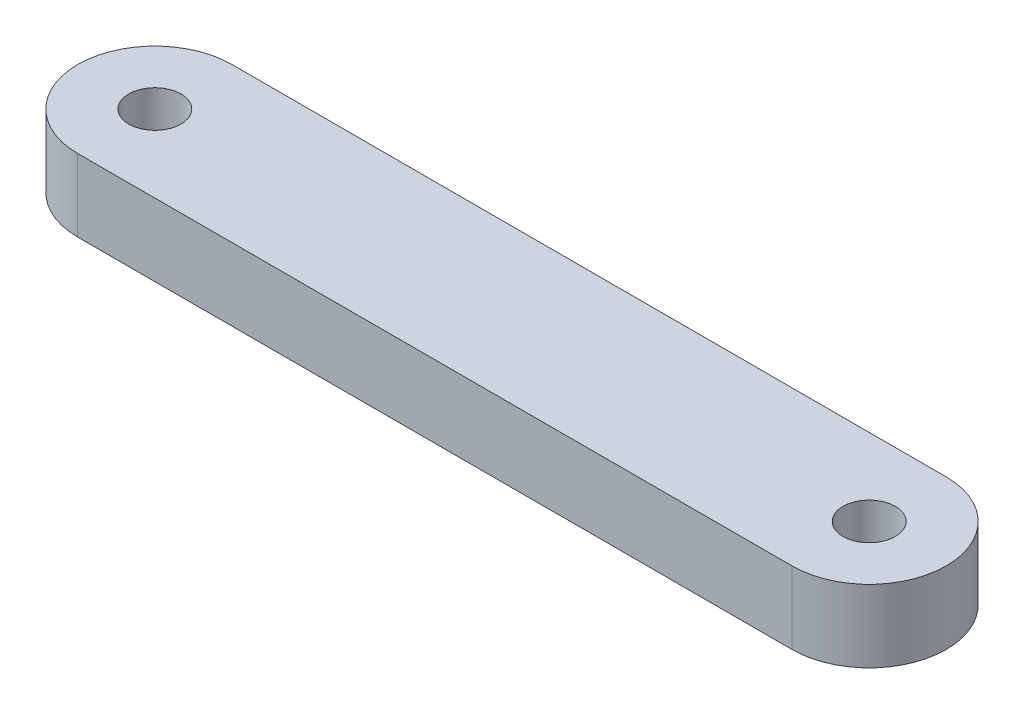
ISO-10303-21;
HEADER;
FILE_DESCRIPTION(('STEP AP214'),'2;1');
FILE_NAME('part.step','',(''),(''),'','','');
FILE_SCHEMA(('AUTOMOTIVE_DESIGN { 1 0 10303 214 1 1 1 1 }'));
ENDSEC;
DATA;
#1=APPLICATION_CONTEXT('core data for automotive mechanical design processes');
#2=APPLICATION_PROTOCOL_DEFINITION('international standard','automotive_design',2000,#1);
#3=PRODUCT_CONTEXT('',#1,'mechanical');
#4=PRODUCT('Part','Part','',(#3));
#5=PRODUCT_RELATED_PRODUCT_CATEGORY('part','',(#4));
#6=PRODUCT_DEFINITION_FORMATION('','',#4);
#7=PRODUCT_DEFINITION_CONTEXT('part definition',#1,'design');
#8=PRODUCT_DEFINITION('design','',#6,#7);
#9=PRODUCT_DEFINITION_SHAPE('','',#8);
#10=(LENGTH_UNIT() NAMED_UNIT(*) SI_UNIT(.MILLI.,.METRE.));
#11=(NAMED_UNIT(*) PLANE_ANGLE_UNIT() SI_UNIT($,.RADIAN.));
#12=(NAMED_UNIT(*) SI_UNIT($,.STERADIAN.) SOLID_ANGLE_UNIT());
#13=UNCERTAINTY_MEASURE_WITH_UNIT(LENGTH_MEASURE(1.E-05),#10,'distance_accuracy_value','');
#14=(GEOMETRIC_REPRESENTATION_CONTEXT(3) GLOBAL_UNCERTAINTY_ASSIGNED_CONTEXT((#13)) GLOBAL_UNIT_ASSIGNED_CONTEXT((#10,
#11,#12)) REPRESENTATION_CONTEXT('',''));
#15=CARTESIAN_POINT('',(0.,0.,0.));
#16=DIRECTION('',(0.,0.,1.));
#17=DIRECTION('',(1.,0.,0.));
#18=AXIS2_PLACEMENT_3D('',#15,#16,#17);
#19=CARTESIAN_POINT('',(0.,6.35,0.));
#20=DIRECTION('',(0.,1.,0.));
#21=DIRECTION('',(0.,0.,1.));
#22=AXIS2_PLACEMENT_3D('',#19,#20,#21);
#23=PLANE('',#22);
#24=CARTESIAN_POINT('',(-62.6695186481077,6.35,0.));
#25=DIRECTION('',(0.,1.,0.));
#26=DIRECTION('',(0.,0.,1.));
#27=AXIS2_PLACEMENT_3D('',#24,#25,#26);
#28=CIRCLE('',#27,2.29235);
#29=CARTESIAN_POINT('',(-62.6695186481077,6.35,2.29235));
#30=VERTEX_POINT('',#29);
#31=EDGE_CURVE('E100',#30,#30,#28,.T.);
#32=ORIENTED_EDGE('',*,*,#31,.F.);
#33=EDGE_LOOP('',(#32));
#34=FACE_BOUND('',#33,.T.);
#35=CARTESIAN_POINT('',(0.,6.35,0.));
#36=DIRECTION('',(0.,1.,0.));
#37=DIRECTION('',(0.,0.,1.));
#38=AXIS2_PLACEMENT_3D('',#35,#36,#37);
#39=CIRCLE('',#38,6.76524067594616);
#40=CARTESIAN_POINT('',(0.,6.35,6.76524067594616));
#41=VERTEX_POINT('',#40);
#42=CARTESIAN_POINT('',(0.,6.35,-6.76524067594616));
#43=VERTEX_POINT('',#42);
#44=EDGE_CURVE('E85',#41,#43,#39,.T.);
#45=ORIENTED_EDGE('',*,*,#44,.T.);
#46=DIRECTION('',(-1.,0.,0.));
#47=VECTOR('',#46,1.);
#48=CARTESIAN_POINT('',(0.,6.35,-6.76524067594616));
#49=LINE('',#48,#47);
#50=CARTESIAN_POINT('',(-62.6695186481077,6.35,-6.76524067594615));
#51=VERTEX_POINT('',#50);
#52=EDGE_CURVE('E80',#43,#51,#49,.T.);
#53=ORIENTED_EDGE('',*,*,#52,.T.);
#54=CARTESIAN_POINT('',(-62.6695186481077,6.35,0.));
#55=DIRECTION('',(0.,1.,0.));
#56=DIRECTION('',(0.,0.,1.));
#57=AXIS2_PLACEMENT_3D('',#54,#55,#56);
#58=CIRCLE('',#57,6.76524067594616);
#59=CARTESIAN_POINT('',(-62.6695186481077,6.35,6.76524067594616));
#60=VERTEX_POINT('',#59);
#61=EDGE_CURVE('E83',#51,#60,#58,.T.);
#62=ORIENTED_EDGE('',*,*,#61,.T.);
#63=DIRECTION('',(1.,0.,0.));
#64=VECTOR('',#63,1.);
#65=CARTESIAN_POINT('',(0.,6.35,6.76524067594616));
#66=LINE('',#65,#64);
#67=EDGE_CURVE('E50',#60,#41,#66,.T.);
#68=ORIENTED_EDGE('',*,*,#67,.T.);
#69=EDGE_LOOP('',(#45,#53,#62,#68));
#70=FACE_BOUND('',#69,.T.);
#71=CARTESIAN_POINT('',(0.,6.35,0.));
#72=DIRECTION('',(0.,1.,0.));
#73=DIRECTION('',(0.,0.,1.));
#74=AXIS2_PLACEMENT_3D('',#71,#72,#73);
#75=CIRCLE('',#74,2.29235);
#76=CARTESIAN_POINT('',(0.,6.35,2.29235));
#77=VERTEX_POINT('',#76);
#78=EDGE_CURVE('E115',#77,#77,#75,.T.);
#79=ORIENTED_EDGE('',*,*,#78,.F.);
#80=EDGE_LOOP('',(#79));
#81=FACE_BOUND('',#80,.T.);
#82=ADVANCED_FACE('F33',(#34,#70,#81),#23,.T.);
#83=CARTESIAN_POINT('',(0.,0.,0.));
#84=DIRECTION('',(0.,1.,0.));
#85=DIRECTION('',(0.,0.,1.));
#86=AXIS2_PLACEMENT_3D('',#83,#84,#85);
#87=PLANE('',#86);
#88=CARTESIAN_POINT('',(0.,0.,0.));
#89=DIRECTION('',(0.,1.,0.));
#90=DIRECTION('',(0.,0.,1.));
#91=AXIS2_PLACEMENT_3D('',#88,#89,#90);
#92=CIRCLE('',#91,6.76524067594616);
#93=CARTESIAN_POINT('',(0.,0.,6.76524067594616));
#94=VERTEX_POINT('',#93);
#95=CARTESIAN_POINT('',(0.,0.,-6.76524067594616));
#96=VERTEX_POINT('',#95);
#97=EDGE_CURVE('E97',#94,#96,#92,.T.);
#98=ORIENTED_EDGE('',*,*,#97,.F.);
#99=DIRECTION('',(1.,0.,0.));
#100=VECTOR('',#99,1.);
#101=CARTESIAN_POINT('',(0.,0.,6.76524067594616));
#102=LINE('',#101,#100);
#103=CARTESIAN_POINT('',(-62.6695186481077,0.,6.76524067594616));
#104=VERTEX_POINT('',#103);
#105=EDGE_CURVE('E73',#104,#94,#102,.T.);
#106=ORIENTED_EDGE('',*,*,#105,.F.);
#107=CARTESIAN_POINT('',(-62.6695186481077,0.,0.));
#108=DIRECTION('',(0.,1.,0.));
#109=DIRECTION('',(0.,0.,1.));
#110=AXIS2_PLACEMENT_3D('',#107,#108,#109);
#111=CIRCLE('',#110,6.76524067594616);
#112=CARTESIAN_POINT('',(-62.6695186481077,0.,-6.76524067594615));
#113=VERTEX_POINT('',#112);
#114=EDGE_CURVE('E67',#113,#104,#111,.T.);
#115=ORIENTED_EDGE('',*,*,#114,.F.);
#116=DIRECTION('',(-1.,0.,0.));
#117=VECTOR('',#116,1.);
#118=CARTESIAN_POINT('',(0.,0.,-6.76524067594616));
#119=LINE('',#118,#117);
#120=EDGE_CURVE('E89',#96,#113,#119,.T.);
#121=ORIENTED_EDGE('',*,*,#120,.F.);
#122=EDGE_LOOP('',(#98,#106,#115,#121));
#123=FACE_BOUND('',#122,.T.);
#124=CARTESIAN_POINT('',(-62.6695186481077,0.,0.));
#125=DIRECTION('',(0.,1.,0.));
#126=DIRECTION('',(0.,0.,1.));
#127=AXIS2_PLACEMENT_3D('',#124,#125,#126);
#128=CIRCLE('',#127,2.29235);
#129=CARTESIAN_POINT('',(-62.6695186481077,0.,2.29235));
#130=VERTEX_POINT('',#129);
#131=EDGE_CURVE('E112',#130,#130,#128,.T.);
#132=ORIENTED_EDGE('',*,*,#131,.T.);
#133=EDGE_LOOP('',(#132));
#134=FACE_BOUND('',#133,.T.);
#135=CARTESIAN_POINT('',(0.,0.,0.));
#136=DIRECTION('',(0.,1.,0.));
#137=DIRECTION('',(0.,0.,1.));
#138=AXIS2_PLACEMENT_3D('',#135,#136,#137);
#139=CIRCLE('',#138,2.29235);
#140=CARTESIAN_POINT('',(0.,0.,2.29235));
#141=VERTEX_POINT('',#140);
#142=EDGE_CURVE('E118',#141,#141,#139,.T.);
#143=ORIENTED_EDGE('',*,*,#142,.T.);
#144=EDGE_LOOP('',(#143));
#145=FACE_BOUND('',#144,.T.);
#146=ADVANCED_FACE('F108',(#123,#134,#145),#87,.F.);
#147=CARTESIAN_POINT('',(0.,6.35,0.));
#148=DIRECTION('',(0.,-1.,0.));
#149=DIRECTION('',(0.,0.,-1.));
#150=AXIS2_PLACEMENT_3D('',#147,#148,#149);
#151=CYLINDRICAL_SURFACE('',#150,6.76524067594616);
#152=ORIENTED_EDGE('',*,*,#97,.T.);
#153=DIRECTION('',(0.,-1.,0.));
#154=VECTOR('',#153,1.);
#155=CARTESIAN_POINT('',(0.,6.35,-6.76524067594616));
#156=LINE('',#155,#154);
#157=EDGE_CURVE('E11',#43,#96,#156,.T.);
#158=ORIENTED_EDGE('',*,*,#157,.F.);
#159=ORIENTED_EDGE('',*,*,#44,.F.);
#160=DIRECTION('',(0.,-1.,0.));
#161=VECTOR('',#160,1.);
#162=CARTESIAN_POINT('',(0.,6.35,6.76524067594616));
#163=LINE('',#162,#161);
#164=EDGE_CURVE('E93',#41,#94,#163,.T.);
#165=ORIENTED_EDGE('',*,*,#164,.T.);
#166=EDGE_LOOP('',(#152,#158,#159,#165));
#167=FACE_BOUND('',#166,.T.);
#168=ADVANCED_FACE('F35',(#167),#151,.T.);
#169=CARTESIAN_POINT('',(0.,6.35,-6.76524067594616));
#170=DIRECTION('',(0.,0.,1.));
#171=DIRECTION('',(1.,0.,0.));
#172=AXIS2_PLACEMENT_3D('',#169,#170,#171);
#173=PLANE('',#172);
#174=ORIENTED_EDGE('',*,*,#120,.T.);
#175=DIRECTION('',(0.,-1.,0.));
#176=VECTOR('',#175,1.);
#177=CARTESIAN_POINT('',(-62.6695186481077,6.35,-6.76524067594615));
#178=LINE('',#177,#176);
#179=EDGE_CURVE('E42',#51,#113,#178,.T.);
#180=ORIENTED_EDGE('',*,*,#179,.F.);
#181=ORIENTED_EDGE('',*,*,#52,.F.);
#182=ORIENTED_EDGE('',*,*,#157,.T.);
#183=EDGE_LOOP('',(#174,#180,#181,#182));
#184=FACE_BOUND('',#183,.T.);
#185=ADVANCED_FACE('F88',(#184),#173,.F.);
#186=CARTESIAN_POINT('',(-62.6695186481077,6.35,0.));
#187=DIRECTION('',(0.,-1.,0.));
#188=DIRECTION('',(0.,0.,-1.));
#189=AXIS2_PLACEMENT_3D('',#186,#187,#188);
#190=CYLINDRICAL_SURFACE('',#189,6.76524067594616);
#191=ORIENTED_EDGE('',*,*,#114,.T.);
#192=DIRECTION('',(0.,-1.,0.));
#193=VECTOR('',#192,1.);
#194=CARTESIAN_POINT('',(-62.6695186481077,6.35,6.76524067594616));
#195=LINE('',#194,#193);
#196=EDGE_CURVE('E90',#60,#104,#195,.T.);
#197=ORIENTED_EDGE('',*,*,#196,.F.);
#198=ORIENTED_EDGE('',*,*,#61,.F.);
#199=ORIENTED_EDGE('',*,*,#179,.T.);
#200=EDGE_LOOP('',(#191,#197,#198,#199));
#201=FACE_BOUND('',#200,.T.);
#202=ADVANCED_FACE('F91',(#201),#190,.T.);
#203=CARTESIAN_POINT('',(0.,6.35,6.76524067594616));
#204=DIRECTION('',(0.,0.,-1.));
#205=DIRECTION('',(-1.,0.,0.));
#206=AXIS2_PLACEMENT_3D('',#203,#204,#205);
#207=PLANE('',#206);
#208=ORIENTED_EDGE('',*,*,#105,.T.);
#209=ORIENTED_EDGE('',*,*,#164,.F.);
#210=ORIENTED_EDGE('',*,*,#67,.F.);
#211=ORIENTED_EDGE('',*,*,#196,.T.);
#212=EDGE_LOOP('',(#208,#209,#210,#211));
#213=FACE_BOUND('',#212,.T.);
#214=ADVANCED_FACE('F105',(#213),#207,.F.);
#215=CARTESIAN_POINT('',(-62.6695186481077,6.35,0.));
#216=DIRECTION('',(0.,-1.,0.));
#217=DIRECTION('',(0.,0.,-1.));
#218=AXIS2_PLACEMENT_3D('',#215,#216,#217);
#219=CYLINDRICAL_SURFACE('',#218,2.29235);
#220=ORIENTED_EDGE('',*,*,#31,.T.);
#221=EDGE_LOOP('',(#220));
#222=FACE_BOUND('',#221,.T.);
#223=ORIENTED_EDGE('',*,*,#131,.F.);
#224=EDGE_LOOP('',(#223));
#225=FACE_BOUND('',#224,.T.);
#226=ADVANCED_FACE('F135',(#222,#225),#219,.F.);
#227=CARTESIAN_POINT('',(0.,6.35,0.));
#228=DIRECTION('',(0.,-1.,0.));
#229=DIRECTION('',(0.,0.,-1.));
#230=AXIS2_PLACEMENT_3D('',#227,#228,#229);
#231=CYLINDRICAL_SURFACE('',#230,2.29235);
#232=ORIENTED_EDGE('',*,*,#78,.T.);
#233=EDGE_LOOP('',(#232));
#234=FACE_BOUND('',#233,.T.);
#235=ORIENTED_EDGE('',*,*,#142,.F.);
#236=EDGE_LOOP('',(#235));
#237=FACE_BOUND('',#236,.T.);
#238=ADVANCED_FACE('F124',(#234,#237),#231,.F.);
#239=CLOSED_SHELL('',(#82,#146,#168,#185,#202,#214,#226,#238));
#240=MANIFOLD_SOLID_BREP('B2',#239);
#241=ADVANCED_BREP_SHAPE_REPRESENTATION('',(#18,#240),#14);
#242=SHAPE_DEFINITION_REPRESENTATION(#9,#241);
ENDSEC;
END-ISO-10303-21;
